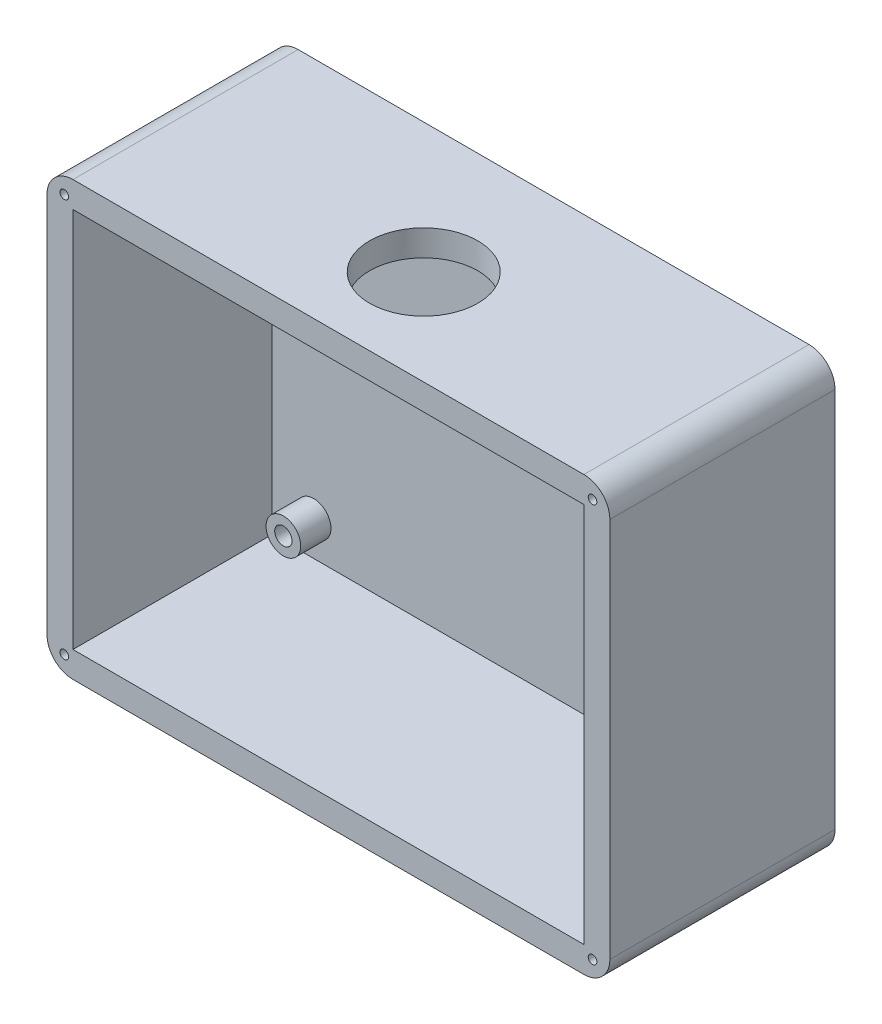
ISO-10303-21;
HEADER;
FILE_DESCRIPTION(('STEP AP214'),'2;1');
FILE_NAME('part.step','',(''),(''),'','','');
FILE_SCHEMA(('AUTOMOTIVE_DESIGN { 1 0 10303 214 1 1 1 1 }'));
ENDSEC;
DATA;
#1=APPLICATION_CONTEXT('core data for automotive mechanical design processes');
#2=APPLICATION_PROTOCOL_DEFINITION('international standard','automotive_design',2000,#1);
#3=PRODUCT_CONTEXT('',#1,'mechanical');
#4=PRODUCT('Part','Part','',(#3));
#5=PRODUCT_RELATED_PRODUCT_CATEGORY('part','',(#4));
#6=PRODUCT_DEFINITION_FORMATION('','',#4);
#7=PRODUCT_DEFINITION_CONTEXT('part definition',#1,'design');
#8=PRODUCT_DEFINITION('design','',#6,#7);
#9=PRODUCT_DEFINITION_SHAPE('','',#8);
#10=(LENGTH_UNIT() NAMED_UNIT(*) SI_UNIT(.MILLI.,.METRE.));
#11=(NAMED_UNIT(*) PLANE_ANGLE_UNIT() SI_UNIT($,.RADIAN.));
#12=(NAMED_UNIT(*) SI_UNIT($,.STERADIAN.) SOLID_ANGLE_UNIT());
#13=UNCERTAINTY_MEASURE_WITH_UNIT(LENGTH_MEASURE(1.E-05),#10,'distance_accuracy_value','');
#14=(GEOMETRIC_REPRESENTATION_CONTEXT(3) GLOBAL_UNCERTAINTY_ASSIGNED_CONTEXT((#13)) GLOBAL_UNIT_ASSIGNED_CONTEXT((#10,
#11,#12)) REPRESENTATION_CONTEXT('',''));
#15=CARTESIAN_POINT('',(0.,0.,0.));
#16=DIRECTION('',(0.,0.,1.));
#17=DIRECTION('',(1.,0.,0.));
#18=AXIS2_PLACEMENT_3D('',#15,#16,#17);
#19=CARTESIAN_POINT('',(0.,0.,3.));
#20=DIRECTION('',(0.,0.,1.));
#21=DIRECTION('',(1.,0.,0.));
#22=AXIS2_PLACEMENT_3D('',#19,#20,#21);
#23=PLANE('',#22);
#24=DIRECTION('',(-1.,0.,0.));
#25=VECTOR('',#24,1.);
#26=CARTESIAN_POINT('',(3.,-3.,3.));
#27=LINE('',#26,#25);
#28=CARTESIAN_POINT('',(62.,-3.,3.));
#29=VERTEX_POINT('',#28);
#30=CARTESIAN_POINT('',(3.,-3.,3.));
#31=VERTEX_POINT('',#30);
#32=EDGE_CURVE('E206',#29,#31,#27,.T.);
#33=ORIENTED_EDGE('',*,*,#32,.T.);
#34=DIRECTION('',(0.,-1.,0.));
#35=VECTOR('',#34,1.);
#36=CARTESIAN_POINT('',(3.,-3.,3.));
#37=LINE('',#36,#35);
#38=CARTESIAN_POINT('',(3.,-47.,3.));
#39=VERTEX_POINT('',#38);
#40=EDGE_CURVE('E221',#31,#39,#37,.T.);
#41=ORIENTED_EDGE('',*,*,#40,.T.);
#42=DIRECTION('',(1.,0.,0.));
#43=VECTOR('',#42,1.);
#44=CARTESIAN_POINT('',(3.,-47.,3.));
#45=LINE('',#44,#43);
#46=CARTESIAN_POINT('',(62.,-47.,3.));
#47=VERTEX_POINT('',#46);
#48=EDGE_CURVE('E223',#39,#47,#45,.T.);
#49=ORIENTED_EDGE('',*,*,#48,.T.);
#50=DIRECTION('',(0.,1.,0.));
#51=VECTOR('',#50,1.);
#52=CARTESIAN_POINT('',(62.,-3.,3.));
#53=LINE('',#52,#51);
#54=EDGE_CURVE('E212',#47,#29,#53,.T.);
#55=ORIENTED_EDGE('',*,*,#54,.T.);
#56=EDGE_LOOP('',(#33,#41,#49,#55));
#57=FACE_BOUND('',#56,.T.);
#58=CARTESIAN_POINT('',(7.79778621450866,-7.,3.));
#59=DIRECTION('',(0.,0.,1.));
#60=DIRECTION('',(1.,0.,0.));
#61=AXIS2_PLACEMENT_3D('',#58,#59,#60);
#62=CIRCLE('',#61,2.);
#63=CARTESIAN_POINT('',(9.79778621450866,-7.,3.));
#64=VERTEX_POINT('',#63);
#65=EDGE_CURVE('E202',#64,#64,#62,.T.);
#66=ORIENTED_EDGE('',*,*,#65,.F.);
#67=EDGE_LOOP('',(#66));
#68=FACE_BOUND('',#67,.T.);
#69=CARTESIAN_POINT('',(56.7977862145087,-7.,3.));
#70=DIRECTION('',(0.,0.,1.));
#71=DIRECTION('',(1.,0.,0.));
#72=AXIS2_PLACEMENT_3D('',#69,#70,#71);
#73=CIRCLE('',#72,2.);
#74=CARTESIAN_POINT('',(58.7977862145087,-7.,3.));
#75=VERTEX_POINT('',#74);
#76=EDGE_CURVE('E193',#75,#75,#73,.T.);
#77=ORIENTED_EDGE('',*,*,#76,.F.);
#78=EDGE_LOOP('',(#77));
#79=FACE_BOUND('',#78,.T.);
#80=CARTESIAN_POINT('',(56.7977862145087,-43.,3.));
#81=DIRECTION('',(0.,0.,1.));
#82=DIRECTION('',(1.,0.,0.));
#83=AXIS2_PLACEMENT_3D('',#80,#81,#82);
#84=CIRCLE('',#83,2.);
#85=CARTESIAN_POINT('',(58.7977862145087,-43.,3.));
#86=VERTEX_POINT('',#85);
#87=EDGE_CURVE('E184',#86,#86,#84,.T.);
#88=ORIENTED_EDGE('',*,*,#87,.F.);
#89=EDGE_LOOP('',(#88));
#90=FACE_BOUND('',#89,.T.);
#91=CARTESIAN_POINT('',(7.79778621450866,-43.,3.));
#92=DIRECTION('',(0.,0.,1.));
#93=DIRECTION('',(1.,0.,0.));
#94=AXIS2_PLACEMENT_3D('',#91,#92,#93);
#95=CIRCLE('',#94,2.);
#96=CARTESIAN_POINT('',(9.79778621450866,-43.,3.));
#97=VERTEX_POINT('',#96);
#98=EDGE_CURVE('E175',#97,#97,#95,.T.);
#99=ORIENTED_EDGE('',*,*,#98,.F.);
#100=EDGE_LOOP('',(#99));
#101=FACE_BOUND('',#100,.T.);
#102=ADVANCED_FACE('F33',(#57,#68,#79,#90,#101),#23,.T.);
#103=CARTESIAN_POINT('',(0.,0.,3.));
#104=DIRECTION('',(1.,0.,0.));
#105=DIRECTION('',(0.,1.,0.));
#106=AXIS2_PLACEMENT_3D('',#103,#104,#105);
#107=PLANE('',#106);
#108=DIRECTION('',(0.,-1.,0.));
#109=VECTOR('',#108,1.);
#110=CARTESIAN_POINT('',(0.,0.,26.));
#111=LINE('',#110,#109);
#112=CARTESIAN_POINT('',(0.,-3.,26.));
#113=VERTEX_POINT('',#112);
#114=CARTESIAN_POINT('',(0.,-47.,26.));
#115=VERTEX_POINT('',#114);
#116=EDGE_CURVE('E237',#113,#115,#111,.T.);
#117=ORIENTED_EDGE('',*,*,#116,.F.);
#118=DIRECTION('',(0.,0.,-1.));
#119=VECTOR('',#118,1.);
#120=CARTESIAN_POINT('',(0.,-3.,3.));
#121=LINE('',#120,#119);
#122=CARTESIAN_POINT('',(0.,-3.,0.));
#123=VERTEX_POINT('',#122);
#124=EDGE_CURVE('E272',#113,#123,#121,.T.);
#125=ORIENTED_EDGE('',*,*,#124,.T.);
#126=DIRECTION('',(0.,-1.,0.));
#127=VECTOR('',#126,1.);
#128=CARTESIAN_POINT('',(0.,0.,0.));
#129=LINE('',#128,#127);
#130=CARTESIAN_POINT('',(0.,-47.,0.));
#131=VERTEX_POINT('',#130);
#132=EDGE_CURVE('E247',#123,#131,#129,.T.);
#133=ORIENTED_EDGE('',*,*,#132,.T.);
#134=DIRECTION('',(0.,0.,-1.));
#135=VECTOR('',#134,1.);
#136=CARTESIAN_POINT('',(0.,-47.,3.));
#137=LINE('',#136,#135);
#138=EDGE_CURVE('E270',#131,#115,#137,.F.);
#139=ORIENTED_EDGE('',*,*,#138,.T.);
#140=EDGE_LOOP('',(#117,#125,#133,#139));
#141=FACE_BOUND('',#140,.T.);
#142=ADVANCED_FACE('F332',(#141),#107,.F.);
#143=CARTESIAN_POINT('',(0.,-50.,3.));
#144=DIRECTION('',(0.,1.,0.));
#145=DIRECTION('',(0.,0.,1.));
#146=AXIS2_PLACEMENT_3D('',#143,#144,#145);
#147=PLANE('',#146);
#148=DIRECTION('',(1.,0.,0.));
#149=VECTOR('',#148,1.);
#150=CARTESIAN_POINT('',(0.,-50.,0.));
#151=LINE('',#150,#149);
#152=CARTESIAN_POINT('',(3.00000000000001,-50.,0.));
#153=VERTEX_POINT('',#152);
#154=CARTESIAN_POINT('',(62.,-50.,0.));
#155=VERTEX_POINT('',#154);
#156=EDGE_CURVE('E250',#153,#155,#151,.T.);
#157=ORIENTED_EDGE('',*,*,#156,.T.);
#158=DIRECTION('',(0.,0.,-1.));
#159=VECTOR('',#158,1.);
#160=CARTESIAN_POINT('',(62.,-50.,3.));
#161=LINE('',#160,#159);
#162=CARTESIAN_POINT('',(62.,-50.,26.));
#163=VERTEX_POINT('',#162);
#164=EDGE_CURVE('E11',#155,#163,#161,.F.);
#165=ORIENTED_EDGE('',*,*,#164,.T.);
#166=DIRECTION('',(1.,0.,0.));
#167=VECTOR('',#166,1.);
#168=CARTESIAN_POINT('',(0.,-50.,26.));
#169=LINE('',#168,#167);
#170=CARTESIAN_POINT('',(3.00000000000001,-50.,26.));
#171=VERTEX_POINT('',#170);
#172=EDGE_CURVE('E240',#171,#163,#169,.T.);
#173=ORIENTED_EDGE('',*,*,#172,.F.);
#174=DIRECTION('',(0.,0.,-1.));
#175=VECTOR('',#174,1.);
#176=CARTESIAN_POINT('',(3.00000000000001,-50.,3.));
#177=LINE('',#176,#175);
#178=EDGE_CURVE('E41',#171,#153,#177,.T.);
#179=ORIENTED_EDGE('',*,*,#178,.T.);
#180=EDGE_LOOP('',(#157,#165,#173,#179));
#181=FACE_BOUND('',#180,.T.);
#182=ADVANCED_FACE('F303',(#181),#147,.F.);
#183=CARTESIAN_POINT('',(65.,0.,3.));
#184=DIRECTION('',(-1.,0.,0.));
#185=DIRECTION('',(0.,0.,1.));
#186=AXIS2_PLACEMENT_3D('',#183,#184,#185);
#187=PLANE('',#186);
#188=DIRECTION('',(0.,1.,0.));
#189=VECTOR('',#188,1.);
#190=CARTESIAN_POINT('',(65.,0.,0.));
#191=LINE('',#190,#189);
#192=CARTESIAN_POINT('',(65.,-47.,0.));
#193=VERTEX_POINT('',#192);
#194=CARTESIAN_POINT('',(65.,-3.,0.));
#195=VERTEX_POINT('',#194);
#196=EDGE_CURVE('E253',#193,#195,#191,.T.);
#197=ORIENTED_EDGE('',*,*,#196,.T.);
#198=DIRECTION('',(0.,0.,-1.));
#199=VECTOR('',#198,1.);
#200=CARTESIAN_POINT('',(65.,-3.,3.));
#201=LINE('',#200,#199);
#202=CARTESIAN_POINT('',(65.,-3.,26.));
#203=VERTEX_POINT('',#202);
#204=EDGE_CURVE('E48',#195,#203,#201,.F.);
#205=ORIENTED_EDGE('',*,*,#204,.T.);
#206=DIRECTION('',(0.,1.,0.));
#207=VECTOR('',#206,1.);
#208=CARTESIAN_POINT('',(65.,0.,26.));
#209=LINE('',#208,#207);
#210=CARTESIAN_POINT('',(65.,-47.,26.));
#211=VERTEX_POINT('',#210);
#212=EDGE_CURVE('E242',#211,#203,#209,.T.);
#213=ORIENTED_EDGE('',*,*,#212,.F.);
#214=DIRECTION('',(0.,0.,-1.));
#215=VECTOR('',#214,1.);
#216=CARTESIAN_POINT('',(65.,-47.,3.));
#217=LINE('',#216,#215);
#218=EDGE_CURVE('E295',#211,#193,#217,.T.);
#219=ORIENTED_EDGE('',*,*,#218,.T.);
#220=EDGE_LOOP('',(#197,#205,#213,#219));
#221=FACE_BOUND('',#220,.T.);
#222=ADVANCED_FACE('F314',(#221),#187,.F.);
#223=CARTESIAN_POINT('',(0.,0.,3.));
#224=DIRECTION('',(0.,-1.,0.));
#225=DIRECTION('',(0.,0.,-1.));
#226=AXIS2_PLACEMENT_3D('',#223,#224,#225);
#227=PLANE('',#226);
#228=CARTESIAN_POINT('',(32.5,0.,15.));
#229=DIRECTION('',(0.,1.,0.));
#230=DIRECTION('',(0.,0.,1.));
#231=AXIS2_PLACEMENT_3D('',#228,#229,#230);
#232=CIRCLE('',#231,6.25);
#233=CARTESIAN_POINT('',(32.5,0.,21.25));
#234=VERTEX_POINT('',#233);
#235=EDGE_CURVE('E169',#234,#234,#232,.T.);
#236=ORIENTED_EDGE('',*,*,#235,.F.);
#237=EDGE_LOOP('',(#236));
#238=FACE_BOUND('',#237,.T.);
#239=DIRECTION('',(-1.,0.,0.));
#240=VECTOR('',#239,1.);
#241=CARTESIAN_POINT('',(0.,0.,0.));
#242=LINE('',#241,#240);
#243=CARTESIAN_POINT('',(62.,0.,0.));
#244=VERTEX_POINT('',#243);
#245=CARTESIAN_POINT('',(3.,0.,0.));
#246=VERTEX_POINT('',#245);
#247=EDGE_CURVE('E255',#244,#246,#242,.T.);
#248=ORIENTED_EDGE('',*,*,#247,.T.);
#249=DIRECTION('',(0.,0.,-1.));
#250=VECTOR('',#249,1.);
#251=CARTESIAN_POINT('',(3.,0.,3.));
#252=LINE('',#251,#250);
#253=CARTESIAN_POINT('',(3.,0.,26.));
#254=VERTEX_POINT('',#253);
#255=EDGE_CURVE('E286',#246,#254,#252,.F.);
#256=ORIENTED_EDGE('',*,*,#255,.T.);
#257=DIRECTION('',(-1.,0.,0.));
#258=VECTOR('',#257,1.);
#259=CARTESIAN_POINT('',(0.,0.,26.));
#260=LINE('',#259,#258);
#261=CARTESIAN_POINT('',(62.,0.,26.));
#262=VERTEX_POINT('',#261);
#263=EDGE_CURVE('E244',#262,#254,#260,.T.);
#264=ORIENTED_EDGE('',*,*,#263,.F.);
#265=DIRECTION('',(0.,0.,-1.));
#266=VECTOR('',#265,1.);
#267=CARTESIAN_POINT('',(62.,0.,3.));
#268=LINE('',#267,#266);
#269=EDGE_CURVE('E283',#262,#244,#268,.T.);
#270=ORIENTED_EDGE('',*,*,#269,.T.);
#271=EDGE_LOOP('',(#248,#256,#264,#270));
#272=FACE_BOUND('',#271,.T.);
#273=ADVANCED_FACE('F324',(#238,#272),#227,.F.);
#274=CARTESIAN_POINT('',(0.,0.,0.));
#275=DIRECTION('',(0.,0.,1.));
#276=DIRECTION('',(1.,0.,0.));
#277=AXIS2_PLACEMENT_3D('',#274,#275,#276);
#278=PLANE('',#277);
#279=ORIENTED_EDGE('',*,*,#132,.F.);
#280=CARTESIAN_POINT('',(3.,-3.,0.));
#281=DIRECTION('',(0.,0.,1.));
#282=DIRECTION('',(1.,0.,0.));
#283=AXIS2_PLACEMENT_3D('',#280,#281,#282);
#284=CIRCLE('',#283,3.);
#285=EDGE_CURVE('E281',#123,#246,#284,.F.);
#286=ORIENTED_EDGE('',*,*,#285,.T.);
#287=ORIENTED_EDGE('',*,*,#247,.F.);
#288=CARTESIAN_POINT('',(62.,-3.,0.));
#289=DIRECTION('',(0.,0.,1.));
#290=DIRECTION('',(1.,0.,0.));
#291=AXIS2_PLACEMENT_3D('',#288,#289,#290);
#292=CIRCLE('',#291,3.);
#293=EDGE_CURVE('E279',#244,#195,#292,.F.);
#294=ORIENTED_EDGE('',*,*,#293,.T.);
#295=ORIENTED_EDGE('',*,*,#196,.F.);
#296=CARTESIAN_POINT('',(62.,-47.,0.));
#297=DIRECTION('',(0.,0.,1.));
#298=DIRECTION('',(1.,0.,0.));
#299=AXIS2_PLACEMENT_3D('',#296,#297,#298);
#300=CIRCLE('',#299,3.);
#301=EDGE_CURVE('E277',#193,#155,#300,.F.);
#302=ORIENTED_EDGE('',*,*,#301,.T.);
#303=ORIENTED_EDGE('',*,*,#156,.F.);
#304=CARTESIAN_POINT('',(3.00000000000001,-47.,0.));
#305=DIRECTION('',(0.,0.,1.));
#306=DIRECTION('',(1.,0.,0.));
#307=AXIS2_PLACEMENT_3D('',#304,#305,#306);
#308=CIRCLE('',#307,3.);
#309=EDGE_CURVE('E275',#153,#131,#308,.F.);
#310=ORIENTED_EDGE('',*,*,#309,.T.);
#311=EDGE_LOOP('',(#279,#286,#287,#294,#295,#302,#303,#310));
#312=FACE_BOUND('',#311,.T.);
#313=ADVANCED_FACE('F309',(#312),#278,.F.);
#314=CARTESIAN_POINT('',(0.,0.,26.));
#315=DIRECTION('',(0.,0.,1.));
#316=DIRECTION('',(1.,0.,0.));
#317=AXIS2_PLACEMENT_3D('',#314,#315,#316);
#318=PLANE('',#317);
#319=CARTESIAN_POINT('',(63.,-48.,26.));
#320=DIRECTION('',(0.,0.,1.));
#321=DIRECTION('',(1.,0.,0.));
#322=AXIS2_PLACEMENT_3D('',#319,#320,#321);
#323=CIRCLE('',#322,0.5);
#324=CARTESIAN_POINT('',(63.5,-48.,26.));
#325=VERTEX_POINT('',#324);
#326=EDGE_CURVE('E144',#325,#325,#323,.T.);
#327=ORIENTED_EDGE('',*,*,#326,.F.);
#328=EDGE_LOOP('',(#327));
#329=FACE_BOUND('',#328,.T.);
#330=CARTESIAN_POINT('',(63.,-2.,26.));
#331=DIRECTION('',(0.,0.,1.));
#332=DIRECTION('',(1.,0.,0.));
#333=AXIS2_PLACEMENT_3D('',#330,#331,#332);
#334=CIRCLE('',#333,0.5);
#335=CARTESIAN_POINT('',(63.5,-2.,26.));
#336=VERTEX_POINT('',#335);
#337=EDGE_CURVE('E143',#336,#336,#334,.T.);
#338=ORIENTED_EDGE('',*,*,#337,.F.);
#339=EDGE_LOOP('',(#338));
#340=FACE_BOUND('',#339,.T.);
#341=CARTESIAN_POINT('',(2.,-2.,26.));
#342=DIRECTION('',(0.,0.,1.));
#343=DIRECTION('',(1.,0.,0.));
#344=AXIS2_PLACEMENT_3D('',#341,#342,#343);
#345=CIRCLE('',#344,0.5);
#346=CARTESIAN_POINT('',(2.5,-2.,26.));
#347=VERTEX_POINT('',#346);
#348=EDGE_CURVE('E154',#347,#347,#345,.T.);
#349=ORIENTED_EDGE('',*,*,#348,.F.);
#350=EDGE_LOOP('',(#349));
#351=FACE_BOUND('',#350,.T.);
#352=CARTESIAN_POINT('',(2.,-48.,26.));
#353=DIRECTION('',(0.,0.,1.));
#354=DIRECTION('',(1.,0.,0.));
#355=AXIS2_PLACEMENT_3D('',#352,#353,#354);
#356=CIRCLE('',#355,0.5);
#357=CARTESIAN_POINT('',(2.5,-48.,26.));
#358=VERTEX_POINT('',#357);
#359=EDGE_CURVE('E160',#358,#358,#356,.T.);
#360=ORIENTED_EDGE('',*,*,#359,.F.);
#361=EDGE_LOOP('',(#360));
#362=FACE_BOUND('',#361,.T.);
#363=ORIENTED_EDGE('',*,*,#263,.T.);
#364=CARTESIAN_POINT('',(3.,-3.,26.));
#365=DIRECTION('',(0.,0.,1.));
#366=DIRECTION('',(1.,0.,0.));
#367=AXIS2_PLACEMENT_3D('',#364,#365,#366);
#368=CIRCLE('',#367,3.);
#369=EDGE_CURVE('E293',#254,#113,#368,.T.);
#370=ORIENTED_EDGE('',*,*,#369,.T.);
#371=ORIENTED_EDGE('',*,*,#116,.T.);
#372=CARTESIAN_POINT('',(3.00000000000001,-47.,26.));
#373=DIRECTION('',(0.,0.,1.));
#374=DIRECTION('',(1.,0.,0.));
#375=AXIS2_PLACEMENT_3D('',#372,#373,#374);
#376=CIRCLE('',#375,3.);
#377=EDGE_CURVE('E288',#115,#171,#376,.T.);
#378=ORIENTED_EDGE('',*,*,#377,.T.);
#379=ORIENTED_EDGE('',*,*,#172,.T.);
#380=CARTESIAN_POINT('',(62.,-47.,26.));
#381=DIRECTION('',(0.,0.,1.));
#382=DIRECTION('',(1.,0.,0.));
#383=AXIS2_PLACEMENT_3D('',#380,#381,#382);
#384=CIRCLE('',#383,3.);
#385=EDGE_CURVE('E55',#163,#211,#384,.T.);
#386=ORIENTED_EDGE('',*,*,#385,.T.);
#387=ORIENTED_EDGE('',*,*,#212,.T.);
#388=CARTESIAN_POINT('',(62.,-3.,26.));
#389=DIRECTION('',(0.,0.,1.));
#390=DIRECTION('',(1.,0.,0.));
#391=AXIS2_PLACEMENT_3D('',#388,#389,#390);
#392=CIRCLE('',#391,3.);
#393=EDGE_CURVE('E291',#203,#262,#392,.T.);
#394=ORIENTED_EDGE('',*,*,#393,.T.);
#395=EDGE_LOOP('',(#363,#370,#371,#378,#379,#386,#387,#394));
#396=FACE_BOUND('',#395,.T.);
#397=DIRECTION('',(0.,-1.,0.));
#398=VECTOR('',#397,1.);
#399=CARTESIAN_POINT('',(3.,-3.,26.));
#400=LINE('',#399,#398);
#401=CARTESIAN_POINT('',(3.,-3.,26.));
#402=VERTEX_POINT('',#401);
#403=CARTESIAN_POINT('',(3.,-47.,26.));
#404=VERTEX_POINT('',#403);
#405=EDGE_CURVE('E211',#402,#404,#400,.T.);
#406=ORIENTED_EDGE('',*,*,#405,.F.);
#407=DIRECTION('',(-1.,0.,0.));
#408=VECTOR('',#407,1.);
#409=CARTESIAN_POINT('',(3.,-3.,26.));
#410=LINE('',#409,#408);
#411=CARTESIAN_POINT('',(62.,-3.,26.));
#412=VERTEX_POINT('',#411);
#413=EDGE_CURVE('E209',#412,#402,#410,.T.);
#414=ORIENTED_EDGE('',*,*,#413,.F.);
#415=DIRECTION('',(0.,1.,0.));
#416=VECTOR('',#415,1.);
#417=CARTESIAN_POINT('',(62.,-3.,26.));
#418=LINE('',#417,#416);
#419=CARTESIAN_POINT('',(62.,-47.,26.));
#420=VERTEX_POINT('',#419);
#421=EDGE_CURVE('E217',#420,#412,#418,.T.);
#422=ORIENTED_EDGE('',*,*,#421,.F.);
#423=DIRECTION('',(1.,0.,0.));
#424=VECTOR('',#423,1.);
#425=CARTESIAN_POINT('',(3.,-47.,26.));
#426=LINE('',#425,#424);
#427=EDGE_CURVE('E214',#404,#420,#426,.T.);
#428=ORIENTED_EDGE('',*,*,#427,.F.);
#429=EDGE_LOOP('',(#406,#414,#422,#428));
#430=FACE_BOUND('',#429,.T.);
#431=ADVANCED_FACE('F316',(#329,#340,#351,#362,#396,#430),#318,.T.);
#432=CARTESIAN_POINT('',(3.,-3.,26.));
#433=DIRECTION('',(0.,-1.,0.));
#434=DIRECTION('',(0.,0.,-1.));
#435=AXIS2_PLACEMENT_3D('',#432,#433,#434);
#436=PLANE('',#435);
#437=CARTESIAN_POINT('',(32.5,-3.,15.));
#438=DIRECTION('',(0.,-1.,0.));
#439=DIRECTION('',(0.,0.,-1.));
#440=AXIS2_PLACEMENT_3D('',#437,#438,#439);
#441=CIRCLE('',#440,6.25);
#442=CARTESIAN_POINT('',(32.5,-3.,8.75));
#443=VERTEX_POINT('',#442);
#444=EDGE_CURVE('E166',#443,#443,#441,.F.);
#445=ORIENTED_EDGE('',*,*,#444,.T.);
#446=EDGE_LOOP('',(#445));
#447=FACE_BOUND('',#446,.T.);
#448=ORIENTED_EDGE('',*,*,#32,.F.);
#449=DIRECTION('',(0.,0.,-1.));
#450=VECTOR('',#449,1.);
#451=CARTESIAN_POINT('',(62.,-3.,26.));
#452=LINE('',#451,#450);
#453=EDGE_CURVE('E219',#412,#29,#452,.T.);
#454=ORIENTED_EDGE('',*,*,#453,.F.);
#455=ORIENTED_EDGE('',*,*,#413,.T.);
#456=DIRECTION('',(0.,0.,-1.));
#457=VECTOR('',#456,1.);
#458=CARTESIAN_POINT('',(3.,-3.,26.));
#459=LINE('',#458,#457);
#460=EDGE_CURVE('E234',#402,#31,#459,.T.);
#461=ORIENTED_EDGE('',*,*,#460,.T.);
#462=EDGE_LOOP('',(#448,#454,#455,#461));
#463=FACE_BOUND('',#462,.T.);
#464=ADVANCED_FACE('F433',(#447,#463),#436,.T.);
#465=CARTESIAN_POINT('',(3.,-3.,26.));
#466=DIRECTION('',(1.,0.,0.));
#467=DIRECTION('',(0.,0.,-1.));
#468=AXIS2_PLACEMENT_3D('',#465,#466,#467);
#469=PLANE('',#468);
#470=ORIENTED_EDGE('',*,*,#40,.F.);
#471=ORIENTED_EDGE('',*,*,#460,.F.);
#472=ORIENTED_EDGE('',*,*,#405,.T.);
#473=DIRECTION('',(0.,0.,-1.));
#474=VECTOR('',#473,1.);
#475=CARTESIAN_POINT('',(3.,-47.,26.));
#476=LINE('',#475,#474);
#477=EDGE_CURVE('E231',#404,#39,#476,.T.);
#478=ORIENTED_EDGE('',*,*,#477,.T.);
#479=EDGE_LOOP('',(#470,#471,#472,#478));
#480=FACE_BOUND('',#479,.T.);
#481=ADVANCED_FACE('F429',(#480),#469,.T.);
#482=CARTESIAN_POINT('',(3.,-47.,26.));
#483=DIRECTION('',(0.,1.,0.));
#484=DIRECTION('',(0.,0.,1.));
#485=AXIS2_PLACEMENT_3D('',#482,#483,#484);
#486=PLANE('',#485);
#487=ORIENTED_EDGE('',*,*,#48,.F.);
#488=ORIENTED_EDGE('',*,*,#477,.F.);
#489=ORIENTED_EDGE('',*,*,#427,.T.);
#490=DIRECTION('',(0.,0.,-1.));
#491=VECTOR('',#490,1.);
#492=CARTESIAN_POINT('',(62.,-47.,26.));
#493=LINE('',#492,#491);
#494=EDGE_CURVE('E228',#420,#47,#493,.T.);
#495=ORIENTED_EDGE('',*,*,#494,.T.);
#496=EDGE_LOOP('',(#487,#488,#489,#495));
#497=FACE_BOUND('',#496,.T.);
#498=ADVANCED_FACE('F425',(#497),#486,.T.);
#499=CARTESIAN_POINT('',(62.,-3.,26.));
#500=DIRECTION('',(-1.,0.,0.));
#501=DIRECTION('',(0.,0.,1.));
#502=AXIS2_PLACEMENT_3D('',#499,#500,#501);
#503=PLANE('',#502);
#504=ORIENTED_EDGE('',*,*,#54,.F.);
#505=ORIENTED_EDGE('',*,*,#494,.F.);
#506=ORIENTED_EDGE('',*,*,#421,.T.);
#507=ORIENTED_EDGE('',*,*,#453,.T.);
#508=EDGE_LOOP('',(#504,#505,#506,#507));
#509=FACE_BOUND('',#508,.T.);
#510=ADVANCED_FACE('F418',(#509),#503,.T.);
#511=CARTESIAN_POINT('',(7.79778621450866,-7.,6.5));
#512=DIRECTION('',(0.,0.,1.));
#513=DIRECTION('',(1.,0.,0.));
#514=AXIS2_PLACEMENT_3D('',#511,#512,#513);
#515=PLANE('',#514);
#516=CARTESIAN_POINT('',(7.79778621450866,-7.,6.5));
#517=DIRECTION('',(0.,0.,1.));
#518=DIRECTION('',(1.,0.,0.));
#519=AXIS2_PLACEMENT_3D('',#516,#517,#518);
#520=CIRCLE('',#519,2.);
#521=CARTESIAN_POINT('',(9.79778621450866,-7.,6.5));
#522=VERTEX_POINT('',#521);
#523=EDGE_CURVE('E203',#522,#522,#520,.T.);
#524=ORIENTED_EDGE('',*,*,#523,.T.);
#525=EDGE_LOOP('',(#524));
#526=FACE_BOUND('',#525,.T.);
#527=CARTESIAN_POINT('',(7.79778621450866,-7.,6.5));
#528=DIRECTION('',(0.,0.,1.));
#529=DIRECTION('',(1.,0.,0.));
#530=AXIS2_PLACEMENT_3D('',#527,#528,#529);
#531=CIRCLE('',#530,0.999999999999999);
#532=CARTESIAN_POINT('',(8.79778621450866,-7.,6.5));
#533=VERTEX_POINT('',#532);
#534=EDGE_CURVE('E197',#533,#533,#531,.T.);
#535=ORIENTED_EDGE('',*,*,#534,.F.);
#536=EDGE_LOOP('',(#535));
#537=FACE_BOUND('',#536,.T.);
#538=ADVANCED_FACE('F415',(#526,#537),#515,.T.);
#539=CARTESIAN_POINT('',(7.79778621450866,-7.,6.5));
#540=DIRECTION('',(0.,0.,-1.));
#541=DIRECTION('',(-1.,0.,0.));
#542=AXIS2_PLACEMENT_3D('',#539,#540,#541);
#543=CYLINDRICAL_SURFACE('',#542,2.);
#544=ORIENTED_EDGE('',*,*,#523,.F.);
#545=EDGE_LOOP('',(#544));
#546=FACE_BOUND('',#545,.T.);
#547=ORIENTED_EDGE('',*,*,#65,.T.);
#548=EDGE_LOOP('',(#547));
#549=FACE_BOUND('',#548,.T.);
#550=ADVANCED_FACE('F372',(#546,#549),#543,.T.);
#551=CARTESIAN_POINT('',(7.79778621450866,-7.,6.5));
#552=DIRECTION('',(0.,0.,-1.));
#553=DIRECTION('',(-1.,0.,0.));
#554=AXIS2_PLACEMENT_3D('',#551,#552,#553);
#555=CYLINDRICAL_SURFACE('',#554,0.999999999999999);
#556=ORIENTED_EDGE('',*,*,#534,.T.);
#557=EDGE_LOOP('',(#556));
#558=FACE_BOUND('',#557,.T.);
#559=CARTESIAN_POINT('',(7.79778621450866,-7.,3.));
#560=DIRECTION('',(0.,0.,1.));
#561=DIRECTION('',(1.,0.,0.));
#562=AXIS2_PLACEMENT_3D('',#559,#560,#561);
#563=CIRCLE('',#562,0.999999999999999);
#564=CARTESIAN_POINT('',(8.79778621450866,-7.,3.));
#565=VERTEX_POINT('',#564);
#566=EDGE_CURVE('E258',#565,#565,#563,.F.);
#567=ORIENTED_EDGE('',*,*,#566,.T.);
#568=EDGE_LOOP('',(#567));
#569=FACE_BOUND('',#568,.T.);
#570=ADVANCED_FACE('F362',(#558,#569),#555,.F.);
#571=ORIENTED_EDGE('',*,*,#566,.F.);
#572=EDGE_LOOP('',(#571));
#573=FACE_BOUND('',#572,.T.);
#574=ADVANCED_FACE('F347',(#573),#23,.T.);
#575=CARTESIAN_POINT('',(56.7977862145087,-7.,6.5));
#576=DIRECTION('',(0.,0.,1.));
#577=DIRECTION('',(1.,0.,0.));
#578=AXIS2_PLACEMENT_3D('',#575,#576,#577);
#579=PLANE('',#578);
#580=CARTESIAN_POINT('',(56.7977862145087,-7.,6.5));
#581=DIRECTION('',(0.,0.,1.));
#582=DIRECTION('',(1.,0.,0.));
#583=AXIS2_PLACEMENT_3D('',#580,#581,#582);
#584=CIRCLE('',#583,2.);
#585=CARTESIAN_POINT('',(58.7977862145087,-7.,6.5));
#586=VERTEX_POINT('',#585);
#587=EDGE_CURVE('E194',#586,#586,#584,.T.);
#588=ORIENTED_EDGE('',*,*,#587,.T.);
#589=EDGE_LOOP('',(#588));
#590=FACE_BOUND('',#589,.T.);
#591=CARTESIAN_POINT('',(56.7977862145087,-7.,6.5));
#592=DIRECTION('',(0.,0.,1.));
#593=DIRECTION('',(1.,0.,0.));
#594=AXIS2_PLACEMENT_3D('',#591,#592,#593);
#595=CIRCLE('',#594,1.);
#596=CARTESIAN_POINT('',(57.7977862145087,-7.,6.5));
#597=VERTEX_POINT('',#596);
#598=EDGE_CURVE('E188',#597,#597,#595,.T.);
#599=ORIENTED_EDGE('',*,*,#598,.F.);
#600=EDGE_LOOP('',(#599));
#601=FACE_BOUND('',#600,.T.);
#602=ADVANCED_FACE('F361',(#590,#601),#579,.T.);
#603=CARTESIAN_POINT('',(56.7977862145087,-7.,6.5));
#604=DIRECTION('',(0.,0.,-1.));
#605=DIRECTION('',(-1.,0.,0.));
#606=AXIS2_PLACEMENT_3D('',#603,#604,#605);
#607=CYLINDRICAL_SURFACE('',#606,2.);
#608=ORIENTED_EDGE('',*,*,#587,.F.);
#609=EDGE_LOOP('',(#608));
#610=FACE_BOUND('',#609,.T.);
#611=ORIENTED_EDGE('',*,*,#76,.T.);
#612=EDGE_LOOP('',(#611));
#613=FACE_BOUND('',#612,.T.);
#614=ADVANCED_FACE('F369',(#610,#613),#607,.T.);
#615=CARTESIAN_POINT('',(56.7977862145087,-7.,6.5));
#616=DIRECTION('',(0.,0.,-1.));
#617=DIRECTION('',(-1.,0.,0.));
#618=AXIS2_PLACEMENT_3D('',#615,#616,#617);
#619=CYLINDRICAL_SURFACE('',#618,1.);
#620=ORIENTED_EDGE('',*,*,#598,.T.);
#621=EDGE_LOOP('',(#620));
#622=FACE_BOUND('',#621,.T.);
#623=CARTESIAN_POINT('',(56.7977862145087,-7.,3.));
#624=DIRECTION('',(0.,0.,1.));
#625=DIRECTION('',(1.,0.,0.));
#626=AXIS2_PLACEMENT_3D('',#623,#624,#625);
#627=CIRCLE('',#626,1.);
#628=CARTESIAN_POINT('',(57.7977862145087,-7.,3.));
#629=VERTEX_POINT('',#628);
#630=EDGE_CURVE('E261',#629,#629,#627,.F.);
#631=ORIENTED_EDGE('',*,*,#630,.T.);
#632=EDGE_LOOP('',(#631));
#633=FACE_BOUND('',#632,.T.);
#634=ADVANCED_FACE('F378',(#622,#633),#619,.F.);
#635=ORIENTED_EDGE('',*,*,#630,.F.);
#636=EDGE_LOOP('',(#635));
#637=FACE_BOUND('',#636,.T.);
#638=ADVANCED_FACE('F364',(#637),#23,.T.);
#639=CARTESIAN_POINT('',(56.7977862145087,-43.,6.5));
#640=DIRECTION('',(0.,0.,1.));
#641=DIRECTION('',(1.,0.,0.));
#642=AXIS2_PLACEMENT_3D('',#639,#640,#641);
#643=PLANE('',#642);
#644=CARTESIAN_POINT('',(56.7977862145087,-43.,6.5));
#645=DIRECTION('',(0.,0.,1.));
#646=DIRECTION('',(1.,0.,0.));
#647=AXIS2_PLACEMENT_3D('',#644,#645,#646);
#648=CIRCLE('',#647,2.);
#649=CARTESIAN_POINT('',(58.7977862145087,-43.,6.5));
#650=VERTEX_POINT('',#649);
#651=EDGE_CURVE('E185',#650,#650,#648,.T.);
#652=ORIENTED_EDGE('',*,*,#651,.T.);
#653=EDGE_LOOP('',(#652));
#654=FACE_BOUND('',#653,.T.);
#655=CARTESIAN_POINT('',(56.7977862145087,-43.,6.5));
#656=DIRECTION('',(0.,0.,1.));
#657=DIRECTION('',(1.,0.,0.));
#658=AXIS2_PLACEMENT_3D('',#655,#656,#657);
#659=CIRCLE('',#658,1.);
#660=CARTESIAN_POINT('',(57.7977862145087,-43.,6.5));
#661=VERTEX_POINT('',#660);
#662=EDGE_CURVE('E179',#661,#661,#659,.T.);
#663=ORIENTED_EDGE('',*,*,#662,.F.);
#664=EDGE_LOOP('',(#663));
#665=FACE_BOUND('',#664,.T.);
#666=ADVANCED_FACE('F377',(#654,#665),#643,.T.);
#667=CARTESIAN_POINT('',(56.7977862145087,-43.,6.5));
#668=DIRECTION('',(0.,0.,-1.));
#669=DIRECTION('',(-1.,0.,0.));
#670=AXIS2_PLACEMENT_3D('',#667,#668,#669);
#671=CYLINDRICAL_SURFACE('',#670,2.);
#672=ORIENTED_EDGE('',*,*,#651,.F.);
#673=EDGE_LOOP('',(#672));
#674=FACE_BOUND('',#673,.T.);
#675=ORIENTED_EDGE('',*,*,#87,.T.);
#676=EDGE_LOOP('',(#675));
#677=FACE_BOUND('',#676,.T.);
#678=ADVANCED_FACE('F384',(#674,#677),#671,.T.);
#679=CARTESIAN_POINT('',(56.7977862145087,-43.,6.5));
#680=DIRECTION('',(0.,0.,-1.));
#681=DIRECTION('',(-1.,0.,0.));
#682=AXIS2_PLACEMENT_3D('',#679,#680,#681);
#683=CYLINDRICAL_SURFACE('',#682,1.);
#684=ORIENTED_EDGE('',*,*,#662,.T.);
#685=EDGE_LOOP('',(#684));
#686=FACE_BOUND('',#685,.T.);
#687=CARTESIAN_POINT('',(56.7977862145087,-43.,3.));
#688=DIRECTION('',(0.,0.,1.));
#689=DIRECTION('',(1.,0.,0.));
#690=AXIS2_PLACEMENT_3D('',#687,#688,#689);
#691=CIRCLE('',#690,1.);
#692=CARTESIAN_POINT('',(57.7977862145087,-43.,3.));
#693=VERTEX_POINT('',#692);
#694=EDGE_CURVE('E264',#693,#693,#691,.F.);
#695=ORIENTED_EDGE('',*,*,#694,.T.);
#696=EDGE_LOOP('',(#695));
#697=FACE_BOUND('',#696,.T.);
#698=ADVANCED_FACE('F392',(#686,#697),#683,.F.);
#699=ORIENTED_EDGE('',*,*,#694,.F.);
#700=EDGE_LOOP('',(#699));
#701=FACE_BOUND('',#700,.T.);
#702=ADVANCED_FACE('F359',(#701),#23,.T.);
#703=CARTESIAN_POINT('',(7.79778621450866,-43.,6.5));
#704=DIRECTION('',(0.,0.,1.));
#705=DIRECTION('',(1.,0.,0.));
#706=AXIS2_PLACEMENT_3D('',#703,#704,#705);
#707=PLANE('',#706);
#708=CARTESIAN_POINT('',(7.79778621450866,-43.,6.5));
#709=DIRECTION('',(0.,0.,1.));
#710=DIRECTION('',(1.,0.,0.));
#711=AXIS2_PLACEMENT_3D('',#708,#709,#710);
#712=CIRCLE('',#711,2.);
#713=CARTESIAN_POINT('',(9.79778621450866,-43.,6.5));
#714=VERTEX_POINT('',#713);
#715=EDGE_CURVE('E176',#714,#714,#712,.T.);
#716=ORIENTED_EDGE('',*,*,#715,.T.);
#717=EDGE_LOOP('',(#716));
#718=FACE_BOUND('',#717,.T.);
#719=CARTESIAN_POINT('',(7.79778621450866,-43.,6.5));
#720=DIRECTION('',(0.,0.,1.));
#721=DIRECTION('',(1.,0.,0.));
#722=AXIS2_PLACEMENT_3D('',#719,#720,#721);
#723=CIRCLE('',#722,1.);
#724=CARTESIAN_POINT('',(8.79778621450866,-43.,6.5));
#725=VERTEX_POINT('',#724);
#726=EDGE_CURVE('E172',#725,#725,#723,.T.);
#727=ORIENTED_EDGE('',*,*,#726,.F.);
#728=EDGE_LOOP('',(#727));
#729=FACE_BOUND('',#728,.T.);
#730=ADVANCED_FACE('F391',(#718,#729),#707,.T.);
#731=CARTESIAN_POINT('',(7.79778621450866,-43.,6.5));
#732=DIRECTION('',(0.,0.,-1.));
#733=DIRECTION('',(-1.,0.,0.));
#734=AXIS2_PLACEMENT_3D('',#731,#732,#733);
#735=CYLINDRICAL_SURFACE('',#734,2.);
#736=ORIENTED_EDGE('',*,*,#715,.F.);
#737=EDGE_LOOP('',(#736));
#738=FACE_BOUND('',#737,.T.);
#739=ORIENTED_EDGE('',*,*,#98,.T.);
#740=EDGE_LOOP('',(#739));
#741=FACE_BOUND('',#740,.T.);
#742=ADVANCED_FACE('F398',(#738,#741),#735,.T.);
#743=CARTESIAN_POINT('',(7.79778621450866,-43.,6.5));
#744=DIRECTION('',(0.,0.,-1.));
#745=DIRECTION('',(-1.,0.,0.));
#746=AXIS2_PLACEMENT_3D('',#743,#744,#745);
#747=CYLINDRICAL_SURFACE('',#746,1.);
#748=ORIENTED_EDGE('',*,*,#726,.T.);
#749=EDGE_LOOP('',(#748));
#750=FACE_BOUND('',#749,.T.);
#751=CARTESIAN_POINT('',(7.79778621450866,-43.,3.));
#752=DIRECTION('',(0.,0.,1.));
#753=DIRECTION('',(1.,0.,0.));
#754=AXIS2_PLACEMENT_3D('',#751,#752,#753);
#755=CIRCLE('',#754,1.);
#756=CARTESIAN_POINT('',(8.79778621450866,-43.,3.));
#757=VERTEX_POINT('',#756);
#758=EDGE_CURVE('E267',#757,#757,#755,.F.);
#759=ORIENTED_EDGE('',*,*,#758,.T.);
#760=EDGE_LOOP('',(#759));
#761=FACE_BOUND('',#760,.T.);
#762=ADVANCED_FACE('F357',(#750,#761),#747,.F.);
#763=ORIENTED_EDGE('',*,*,#758,.F.);
#764=EDGE_LOOP('',(#763));
#765=FACE_BOUND('',#764,.T.);
#766=ADVANCED_FACE('F346',(#765),#23,.T.);
#767=CARTESIAN_POINT('',(32.5,-50.001,15.));
#768=DIRECTION('',(0.,1.,0.));
#769=DIRECTION('',(0.,0.,1.));
#770=AXIS2_PLACEMENT_3D('',#767,#768,#769);
#771=CYLINDRICAL_SURFACE('',#770,6.25);
#772=ORIENTED_EDGE('',*,*,#444,.F.);
#773=EDGE_LOOP('',(#772));
#774=FACE_BOUND('',#773,.T.);
#775=ORIENTED_EDGE('',*,*,#235,.T.);
#776=EDGE_LOOP('',(#775));
#777=FACE_BOUND('',#776,.T.);
#778=ADVANCED_FACE('F356',(#774,#777),#771,.F.);
#779=CARTESIAN_POINT('',(3.,-3.,3.));
#780=DIRECTION('',(0.,0.,-1.));
#781=DIRECTION('',(-1.,0.,0.));
#782=AXIS2_PLACEMENT_3D('',#779,#780,#781);
#783=CYLINDRICAL_SURFACE('',#782,3.);
#784=ORIENTED_EDGE('',*,*,#369,.F.);
#785=ORIENTED_EDGE('',*,*,#255,.F.);
#786=ORIENTED_EDGE('',*,*,#285,.F.);
#787=ORIENTED_EDGE('',*,*,#124,.F.);
#788=EDGE_LOOP('',(#784,#785,#786,#787));
#789=FACE_BOUND('',#788,.T.);
#790=ADVANCED_FACE('F329',(#789),#783,.T.);
#791=CARTESIAN_POINT('',(62.,-3.,3.));
#792=DIRECTION('',(0.,0.,-1.));
#793=DIRECTION('',(-1.,0.,0.));
#794=AXIS2_PLACEMENT_3D('',#791,#792,#793);
#795=CYLINDRICAL_SURFACE('',#794,3.);
#796=ORIENTED_EDGE('',*,*,#393,.F.);
#797=ORIENTED_EDGE('',*,*,#204,.F.);
#798=ORIENTED_EDGE('',*,*,#293,.F.);
#799=ORIENTED_EDGE('',*,*,#269,.F.);
#800=EDGE_LOOP('',(#796,#797,#798,#799));
#801=FACE_BOUND('',#800,.T.);
#802=ADVANCED_FACE('F321',(#801),#795,.T.);
#803=CARTESIAN_POINT('',(62.,-47.,3.));
#804=DIRECTION('',(0.,0.,-1.));
#805=DIRECTION('',(-1.,0.,0.));
#806=AXIS2_PLACEMENT_3D('',#803,#804,#805);
#807=CYLINDRICAL_SURFACE('',#806,3.);
#808=ORIENTED_EDGE('',*,*,#385,.F.);
#809=ORIENTED_EDGE('',*,*,#164,.F.);
#810=ORIENTED_EDGE('',*,*,#301,.F.);
#811=ORIENTED_EDGE('',*,*,#218,.F.);
#812=EDGE_LOOP('',(#808,#809,#810,#811));
#813=FACE_BOUND('',#812,.T.);
#814=ADVANCED_FACE('F313',(#813),#807,.T.);
#815=CARTESIAN_POINT('',(3.00000000000001,-47.,3.));
#816=DIRECTION('',(0.,0.,-1.));
#817=DIRECTION('',(-1.,0.,0.));
#818=AXIS2_PLACEMENT_3D('',#815,#816,#817);
#819=CYLINDRICAL_SURFACE('',#818,3.);
#820=ORIENTED_EDGE('',*,*,#377,.F.);
#821=ORIENTED_EDGE('',*,*,#138,.F.);
#822=ORIENTED_EDGE('',*,*,#309,.F.);
#823=ORIENTED_EDGE('',*,*,#178,.F.);
#824=EDGE_LOOP('',(#820,#821,#822,#823));
#825=FACE_BOUND('',#824,.T.);
#826=ADVANCED_FACE('F35',(#825),#819,.T.);
#827=CARTESIAN_POINT('',(2.,-48.,11.));
#828=DIRECTION('',(0.,0.,1.));
#829=DIRECTION('',(1.,0.,0.));
#830=AXIS2_PLACEMENT_3D('',#827,#828,#829);
#831=CONICAL_SURFACE('',#830,0.499999999999997,1.02974425867665);
#832=CARTESIAN_POINT('',(2.,-48.,10.6995696904862));
#833=VERTEX_POINT('',#832);
#834=VERTEX_LOOP('',#833);
#835=FACE_BOUND('',#834,.T.);
#836=CARTESIAN_POINT('',(2.,-48.,11.));
#837=DIRECTION('',(0.,0.,1.));
#838=DIRECTION('',(1.,0.,0.));
#839=AXIS2_PLACEMENT_3D('',#836,#837,#838);
#840=CIRCLE('',#839,0.499999999999997);
#841=CARTESIAN_POINT('',(2.5,-48.,11.));
#842=VERTEX_POINT('',#841);
#843=EDGE_CURVE('E163',#842,#842,#840,.T.);
#844=ORIENTED_EDGE('',*,*,#843,.T.);
#845=EDGE_LOOP('',(#844));
#846=FACE_BOUND('',#845,.T.);
#847=ADVANCED_FACE('F335',(#835,#846),#831,.F.);
#848=CARTESIAN_POINT('',(2.,-48.,26.));
#849=DIRECTION('',(0.,0.,1.));
#850=DIRECTION('',(1.,0.,0.));
#851=AXIS2_PLACEMENT_3D('',#848,#849,#850);
#852=CYLINDRICAL_SURFACE('',#851,0.499999999999999);
#853=ORIENTED_EDGE('',*,*,#843,.F.);
#854=EDGE_LOOP('',(#853));
#855=FACE_BOUND('',#854,.T.);
#856=ORIENTED_EDGE('',*,*,#359,.T.);
#857=EDGE_LOOP('',(#856));
#858=FACE_BOUND('',#857,.T.);
#859=ADVANCED_FACE('F340',(#855,#858),#852,.F.);
#860=CARTESIAN_POINT('',(2.,-2.,11.));
#861=DIRECTION('',(0.,0.,1.));
#862=DIRECTION('',(1.,0.,0.));
#863=AXIS2_PLACEMENT_3D('',#860,#861,#862);
#864=CONICAL_SURFACE('',#863,0.499999999999997,1.02974425867665);
#865=CARTESIAN_POINT('',(2.,-2.,10.6995696904862));
#866=VERTEX_POINT('',#865);
#867=VERTEX_LOOP('',#866);
#868=FACE_BOUND('',#867,.T.);
#869=CARTESIAN_POINT('',(2.,-2.,11.));
#870=DIRECTION('',(0.,0.,1.));
#871=DIRECTION('',(1.,0.,0.));
#872=AXIS2_PLACEMENT_3D('',#869,#870,#871);
#873=CIRCLE('',#872,0.499999999999997);
#874=CARTESIAN_POINT('',(2.5,-2.,11.));
#875=VERTEX_POINT('',#874);
#876=EDGE_CURVE('E157',#875,#875,#873,.T.);
#877=ORIENTED_EDGE('',*,*,#876,.T.);
#878=EDGE_LOOP('',(#877));
#879=FACE_BOUND('',#878,.T.);
#880=ADVANCED_FACE('F452',(#868,#879),#864,.F.);
#881=CARTESIAN_POINT('',(2.,-2.,26.));
#882=DIRECTION('',(0.,0.,1.));
#883=DIRECTION('',(1.,0.,0.));
#884=AXIS2_PLACEMENT_3D('',#881,#882,#883);
#885=CYLINDRICAL_SURFACE('',#884,0.499999999999999);
#886=ORIENTED_EDGE('',*,*,#876,.F.);
#887=EDGE_LOOP('',(#886));
#888=FACE_BOUND('',#887,.T.);
#889=ORIENTED_EDGE('',*,*,#348,.T.);
#890=EDGE_LOOP('',(#889));
#891=FACE_BOUND('',#890,.T.);
#892=ADVANCED_FACE('F458',(#888,#891),#885,.F.);
#893=CARTESIAN_POINT('',(63.,-2.,11.));
#894=DIRECTION('',(0.,0.,1.));
#895=DIRECTION('',(1.,0.,0.));
#896=AXIS2_PLACEMENT_3D('',#893,#894,#895);
#897=CONICAL_SURFACE('',#896,0.5,1.02974425867665);
#898=CARTESIAN_POINT('',(63.,-2.,10.6995696904862));
#899=VERTEX_POINT('',#898);
#900=VERTEX_LOOP('',#899);
#901=FACE_BOUND('',#900,.T.);
#902=CARTESIAN_POINT('',(63.,-2.,11.));
#903=DIRECTION('',(0.,0.,1.));
#904=DIRECTION('',(1.,0.,0.));
#905=AXIS2_PLACEMENT_3D('',#902,#903,#904);
#906=CIRCLE('',#905,0.5);
#907=CARTESIAN_POINT('',(63.5,-2.,11.));
#908=VERTEX_POINT('',#907);
#909=EDGE_CURVE('E147',#908,#908,#906,.T.);
#910=ORIENTED_EDGE('',*,*,#909,.T.);
#911=EDGE_LOOP('',(#910));
#912=FACE_BOUND('',#911,.T.);
#913=ADVANCED_FACE('F667',(#901,#912),#897,.F.);
#914=CARTESIAN_POINT('',(63.,-2.,26.));
#915=DIRECTION('',(0.,0.,1.));
#916=DIRECTION('',(1.,0.,0.));
#917=AXIS2_PLACEMENT_3D('',#914,#915,#916);
#918=CYLINDRICAL_SURFACE('',#917,0.5);
#919=ORIENTED_EDGE('',*,*,#909,.F.);
#920=EDGE_LOOP('',(#919));
#921=FACE_BOUND('',#920,.T.);
#922=ORIENTED_EDGE('',*,*,#337,.T.);
#923=EDGE_LOOP('',(#922));
#924=FACE_BOUND('',#923,.T.);
#925=ADVANCED_FACE('F137',(#921,#924),#918,.F.);
#926=CARTESIAN_POINT('',(63.,-48.,11.));
#927=DIRECTION('',(0.,0.,1.));
#928=DIRECTION('',(1.,0.,0.));
#929=AXIS2_PLACEMENT_3D('',#926,#927,#928);
#930=CONICAL_SURFACE('',#929,0.5,1.02974425867665);
#931=CARTESIAN_POINT('',(63.,-48.,10.6995696904862));
#932=VERTEX_POINT('',#931);
#933=VERTEX_LOOP('',#932);
#934=FACE_BOUND('',#933,.T.);
#935=CARTESIAN_POINT('',(63.,-48.,11.));
#936=DIRECTION('',(0.,0.,1.));
#937=DIRECTION('',(1.,0.,0.));
#938=AXIS2_PLACEMENT_3D('',#935,#936,#937);
#939=CIRCLE('',#938,0.5);
#940=CARTESIAN_POINT('',(63.5,-48.,11.));
#941=VERTEX_POINT('',#940);
#942=EDGE_CURVE('E141',#941,#941,#939,.T.);
#943=ORIENTED_EDGE('',*,*,#942,.T.);
#944=EDGE_LOOP('',(#943));
#945=FACE_BOUND('',#944,.T.);
#946=ADVANCED_FACE('F133',(#934,#945),#930,.F.);
#947=CARTESIAN_POINT('',(63.,-48.,26.));
#948=DIRECTION('',(0.,0.,1.));
#949=DIRECTION('',(1.,0.,0.));
#950=AXIS2_PLACEMENT_3D('',#947,#948,#949);
#951=CYLINDRICAL_SURFACE('',#950,0.5);
#952=ORIENTED_EDGE('',*,*,#942,.F.);
#953=EDGE_LOOP('',(#952));
#954=FACE_BOUND('',#953,.T.);
#955=ORIENTED_EDGE('',*,*,#326,.T.);
#956=EDGE_LOOP('',(#955));
#957=FACE_BOUND('',#956,.T.);
#958=ADVANCED_FACE('F136',(#954,#957),#951,.F.);
#959=CLOSED_SHELL('',(#102,#142,#182,#222,#273,#313,#431,#464,#481,#498,#510,#538,#550,#570,
#574,#602,#614,#634,#638,#666,#678,#698,#702,#730,#742,#762,#766,#778,#790,#802,#814,#826,#847,
#859,#880,#892,#913,#925,#946,#958));
#960=MANIFOLD_SOLID_BREP('B2',#959);
#961=ADVANCED_BREP_SHAPE_REPRESENTATION('',(#18,#960),#14);
#962=SHAPE_DEFINITION_REPRESENTATION(#9,#961);
ENDSEC;
END-ISO-10303-21;
